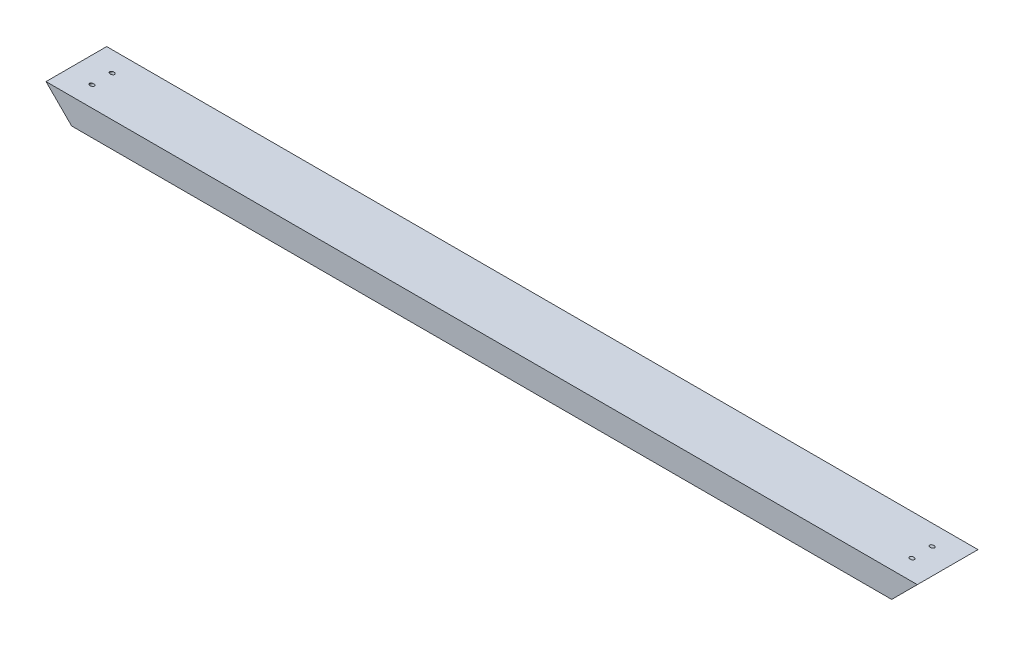
ISO-10303-21;
HEADER;
FILE_DESCRIPTION(('STEP AP214'),'2;1');
FILE_NAME('part.step','',(''),(''),'','','');
FILE_SCHEMA(('AUTOMOTIVE_DESIGN { 1 0 10303 214 1 1 1 1 }'));
ENDSEC;
DATA;
#1=APPLICATION_CONTEXT('core data for automotive mechanical design processes');
#2=APPLICATION_PROTOCOL_DEFINITION('international standard','automotive_design',2000,#1);
#3=PRODUCT_CONTEXT('',#1,'mechanical');
#4=PRODUCT('Part','Part','',(#3));
#5=PRODUCT_RELATED_PRODUCT_CATEGORY('part','',(#4));
#6=PRODUCT_DEFINITION_FORMATION('','',#4);
#7=PRODUCT_DEFINITION_CONTEXT('part definition',#1,'design');
#8=PRODUCT_DEFINITION('design','',#6,#7);
#9=PRODUCT_DEFINITION_SHAPE('','',#8);
#10=(LENGTH_UNIT() NAMED_UNIT(*) SI_UNIT(.MILLI.,.METRE.));
#11=(NAMED_UNIT(*) PLANE_ANGLE_UNIT() SI_UNIT($,.RADIAN.));
#12=(NAMED_UNIT(*) SI_UNIT($,.STERADIAN.) SOLID_ANGLE_UNIT());
#13=UNCERTAINTY_MEASURE_WITH_UNIT(LENGTH_MEASURE(1.E-05),#10,'distance_accuracy_value','');
#14=(GEOMETRIC_REPRESENTATION_CONTEXT(3) GLOBAL_UNCERTAINTY_ASSIGNED_CONTEXT((#13)) GLOBAL_UNIT_ASSIGNED_CONTEXT((#10,
#11,#12)) REPRESENTATION_CONTEXT('',''));
#15=CARTESIAN_POINT('',(0.,0.,0.));
#16=DIRECTION('',(0.,0.,1.));
#17=DIRECTION('',(1.,0.,0.));
#18=AXIS2_PLACEMENT_3D('',#15,#16,#17);
#19=CARTESIAN_POINT('',(-29.25630148811,26.4871636246753,88.9));
#20=DIRECTION('',(0.707106781186548,0.707106781186547,0.));
#21=DIRECTION('',(-0.707106781186547,0.707106781186548,0.));
#22=AXIS2_PLACEMENT_3D('',#19,#20,#21);
#23=PLANE('',#22);
#24=CARTESIAN_POINT('',(-10.4600139123982,7.69087604896351,29.6333333333333));
#25=DIRECTION('',(-0.707106781186549,-0.707106781186546,0.));
#26=DIRECTION('',(0.707106781186546,-0.707106781186549,0.));
#27=AXIS2_PLACEMENT_3D('',#24,#25,#26);
#28=CIRCLE('',#27,2.5796875);
#29=CARTESIAN_POINT('',(-8.63589938780602,5.86676152437133,29.6333333333333));
#30=VERTEX_POINT('',#29);
#31=EDGE_CURVE('E115',#30,#30,#28,.T.);
#32=ORIENTED_EDGE('',*,*,#31,.F.);
#33=EDGE_LOOP('',(#32));
#34=FACE_BOUND('',#33,.T.);
#35=CARTESIAN_POINT('',(-10.4600139123982,7.69087604896351,59.2666666666667));
#36=DIRECTION('',(-0.707106781186549,-0.707106781186546,0.));
#37=DIRECTION('',(0.707106781186546,-0.707106781186549,0.));
#38=AXIS2_PLACEMENT_3D('',#35,#36,#37);
#39=CIRCLE('',#38,2.5796875);
#40=CARTESIAN_POINT('',(-8.63589938780603,5.86676152437134,59.2666666666667));
#41=VERTEX_POINT('',#40);
#42=EDGE_CURVE('E123',#41,#41,#39,.T.);
#43=ORIENTED_EDGE('',*,*,#42,.F.);
#44=EDGE_LOOP('',(#43));
#45=FACE_BOUND('',#44,.T.);
#46=DIRECTION('',(0.707106781186547,-0.707106781186548,0.));
#47=VECTOR('',#46,1.);
#48=CARTESIAN_POINT('',(-29.25630148811,26.4871636246753,0.));
#49=LINE('',#48,#47);
#50=CARTESIAN_POINT('',(-29.25630148811,26.4871636246753,0.));
#51=VERTEX_POINT('',#50);
#52=CARTESIAN_POINT('',(8.33627366331358,-11.1054115267483,0.));
#53=VERTEX_POINT('',#52);
#54=EDGE_CURVE('E103',#51,#53,#49,.T.);
#55=ORIENTED_EDGE('',*,*,#54,.T.);
#56=DIRECTION('',(0.,0.,-1.));
#57=VECTOR('',#56,1.);
#58=CARTESIAN_POINT('',(8.33627366331358,-11.1054115267483,88.9));
#59=LINE('',#58,#57);
#60=CARTESIAN_POINT('',(8.33627366331358,-11.1054115267483,88.9));
#61=VERTEX_POINT('',#60);
#62=EDGE_CURVE('E11',#61,#53,#59,.T.);
#63=ORIENTED_EDGE('',*,*,#62,.F.);
#64=DIRECTION('',(0.707106781186547,-0.707106781186548,0.));
#65=VECTOR('',#64,1.);
#66=CARTESIAN_POINT('',(-29.25630148811,26.4871636246753,88.9));
#67=LINE('',#66,#65);
#68=CARTESIAN_POINT('',(-29.25630148811,26.4871636246753,88.9));
#69=VERTEX_POINT('',#68);
#70=EDGE_CURVE('E90',#69,#61,#67,.T.);
#71=ORIENTED_EDGE('',*,*,#70,.F.);
#72=DIRECTION('',(0.,0.,-1.));
#73=VECTOR('',#72,1.);
#74=CARTESIAN_POINT('',(-29.25630148811,26.4871636246753,88.9));
#75=LINE('',#74,#73);
#76=EDGE_CURVE('E99',#69,#51,#75,.T.);
#77=ORIENTED_EDGE('',*,*,#76,.T.);
#78=EDGE_LOOP('',(#55,#63,#71,#77));
#79=FACE_BOUND('',#78,.T.);
#80=ADVANCED_FACE('F37',(#34,#45,#79),#23,.F.);
#81=CARTESIAN_POINT('',(8.33627366331358,-11.1054115267483,88.9));
#82=DIRECTION('',(0.,1.,0.));
#83=DIRECTION('',(0.,0.,1.));
#84=AXIS2_PLACEMENT_3D('',#81,#82,#83);
#85=PLANE('',#84);
#86=DIRECTION('',(1.,0.,0.));
#87=VECTOR('',#86,1.);
#88=CARTESIAN_POINT('',(8.33627366331358,-11.1054115267483,0.));
#89=LINE('',#88,#87);
#90=CARTESIAN_POINT('',(1209.83189851189,-11.1054115267483,0.));
#91=VERTEX_POINT('',#90);
#92=EDGE_CURVE('E94',#53,#91,#89,.T.);
#93=ORIENTED_EDGE('',*,*,#92,.T.);
#94=DIRECTION('',(0.,0.,-1.));
#95=VECTOR('',#94,1.);
#96=CARTESIAN_POINT('',(1209.83189851189,-11.1054115267483,88.9));
#97=LINE('',#96,#95);
#98=CARTESIAN_POINT('',(1209.83189851189,-11.1054115267483,88.9));
#99=VERTEX_POINT('',#98);
#100=EDGE_CURVE('E46',#99,#91,#97,.T.);
#101=ORIENTED_EDGE('',*,*,#100,.F.);
#102=DIRECTION('',(1.,0.,0.));
#103=VECTOR('',#102,1.);
#104=CARTESIAN_POINT('',(8.33627366331358,-11.1054115267483,88.9));
#105=LINE('',#104,#103);
#106=EDGE_CURVE('E85',#61,#99,#105,.T.);
#107=ORIENTED_EDGE('',*,*,#106,.F.);
#108=ORIENTED_EDGE('',*,*,#62,.T.);
#109=EDGE_LOOP('',(#93,#101,#107,#108));
#110=FACE_BOUND('',#109,.T.);
#111=ADVANCED_FACE('F93',(#110),#85,.F.);
#112=CARTESIAN_POINT('',(1247.42447366331,26.4871636246753,88.9));
#113=DIRECTION('',(-0.707106781186543,0.707106781186553,0.));
#114=DIRECTION('',(-0.707106781186553,-0.707106781186543,0.));
#115=AXIS2_PLACEMENT_3D('',#112,#113,#114);
#116=PLANE('',#115);
#117=CARTESIAN_POINT('',(1228.6281860876,7.69087604896435,59.2666666666667));
#118=DIRECTION('',(0.707106781186544,-0.707106781186551,0.));
#119=DIRECTION('',(0.707106781186551,0.707106781186544,0.));
#120=AXIS2_PLACEMENT_3D('',#117,#118,#119);
#121=CIRCLE('',#120,2.57968750000005);
#122=CARTESIAN_POINT('',(1230.45230061219,9.51499057355655,59.2666666666667));
#123=VERTEX_POINT('',#122);
#124=EDGE_CURVE('E119',#123,#123,#121,.T.);
#125=ORIENTED_EDGE('',*,*,#124,.F.);
#126=EDGE_LOOP('',(#125));
#127=FACE_BOUND('',#126,.T.);
#128=CARTESIAN_POINT('',(1228.6281860876,7.69087604896435,29.6333333333333));
#129=DIRECTION('',(0.707106781186544,-0.707106781186551,0.));
#130=DIRECTION('',(0.707106781186551,0.707106781186544,0.));
#131=AXIS2_PLACEMENT_3D('',#128,#129,#130);
#132=CIRCLE('',#131,2.57968750000004);
#133=CARTESIAN_POINT('',(1230.45230061219,9.51499057355653,29.6333333333333));
#134=VERTEX_POINT('',#133);
#135=EDGE_CURVE('E125',#134,#134,#132,.T.);
#136=ORIENTED_EDGE('',*,*,#135,.F.);
#137=EDGE_LOOP('',(#136));
#138=FACE_BOUND('',#137,.T.);
#139=DIRECTION('',(0.707106781186552,0.707106781186543,0.));
#140=VECTOR('',#139,1.);
#141=CARTESIAN_POINT('',(1247.42447366331,26.4871636246753,0.));
#142=LINE('',#141,#140);
#143=CARTESIAN_POINT('',(1247.42447366331,26.4871636246753,0.));
#144=VERTEX_POINT('',#143);
#145=EDGE_CURVE('E72',#91,#144,#142,.T.);
#146=ORIENTED_EDGE('',*,*,#145,.T.);
#147=DIRECTION('',(0.,0.,-1.));
#148=VECTOR('',#147,1.);
#149=CARTESIAN_POINT('',(1247.42447366331,26.4871636246753,88.9));
#150=LINE('',#149,#148);
#151=CARTESIAN_POINT('',(1247.42447366331,26.4871636246753,88.9));
#152=VERTEX_POINT('',#151);
#153=EDGE_CURVE('E95',#152,#144,#150,.T.);
#154=ORIENTED_EDGE('',*,*,#153,.F.);
#155=DIRECTION('',(0.707106781186552,0.707106781186543,0.));
#156=VECTOR('',#155,1.);
#157=CARTESIAN_POINT('',(1247.42447366331,26.4871636246753,88.9));
#158=LINE('',#157,#156);
#159=EDGE_CURVE('E88',#99,#152,#158,.T.);
#160=ORIENTED_EDGE('',*,*,#159,.F.);
#161=ORIENTED_EDGE('',*,*,#100,.T.);
#162=EDGE_LOOP('',(#146,#154,#160,#161));
#163=FACE_BOUND('',#162,.T.);
#164=ADVANCED_FACE('F97',(#127,#138,#163),#116,.F.);
#165=CARTESIAN_POINT('',(-29.25630148811,26.4871636246753,88.9));
#166=DIRECTION('',(0.,-1.,0.));
#167=DIRECTION('',(0.,0.,-1.));
#168=AXIS2_PLACEMENT_3D('',#165,#166,#167);
#169=PLANE('',#168);
#170=CARTESIAN_POINT('',(1209.83189851189,26.4871636246753,59.2666666666667));
#171=DIRECTION('',(0.,-1.,0.));
#172=DIRECTION('',(1.,0.,0.));
#173=AXIS2_PLACEMENT_3D('',#170,#171,#172);
#174=ELLIPSE('',#173,3.6482290491844,2.57968750000005);
#175=CARTESIAN_POINT('',(1213.48012756107,26.4871636246753,59.2666666666667));
#176=VERTEX_POINT('',#175);
#177=EDGE_CURVE('E40',#176,#176,#174,.T.);
#178=ORIENTED_EDGE('',*,*,#177,.T.);
#179=EDGE_LOOP('',(#178));
#180=FACE_BOUND('',#179,.T.);
#181=CARTESIAN_POINT('',(1209.83189851189,26.4871636246753,29.6333333333333));
#182=DIRECTION('',(0.,-1.,0.));
#183=DIRECTION('',(1.,0.,0.));
#184=AXIS2_PLACEMENT_3D('',#181,#182,#183);
#185=ELLIPSE('',#184,3.64822904918438,2.57968750000004);
#186=CARTESIAN_POINT('',(1213.48012756107,26.4871636246753,29.6333333333333));
#187=VERTEX_POINT('',#186);
#188=EDGE_CURVE('E117',#187,#187,#185,.T.);
#189=ORIENTED_EDGE('',*,*,#188,.T.);
#190=EDGE_LOOP('',(#189));
#191=FACE_BOUND('',#190,.T.);
#192=CARTESIAN_POINT('',(8.3362736633138,26.4871636246753,29.6333333333333));
#193=DIRECTION('',(0.,-1.,0.));
#194=DIRECTION('',(-1.,0.,0.));
#195=AXIS2_PLACEMENT_3D('',#192,#193,#194);
#196=ELLIPSE('',#195,3.64822904918435,2.5796875);
#197=CARTESIAN_POINT('',(4.68804461412944,26.4871636246753,29.6333333333333));
#198=VERTEX_POINT('',#197);
#199=EDGE_CURVE('E106',#198,#198,#196,.T.);
#200=ORIENTED_EDGE('',*,*,#199,.T.);
#201=EDGE_LOOP('',(#200));
#202=FACE_BOUND('',#201,.T.);
#203=CARTESIAN_POINT('',(8.3362736633138,26.4871636246753,59.2666666666667));
#204=DIRECTION('',(0.,-1.,0.));
#205=DIRECTION('',(-1.,0.,0.));
#206=AXIS2_PLACEMENT_3D('',#203,#204,#205);
#207=ELLIPSE('',#206,3.64822904918434,2.5796875);
#208=CARTESIAN_POINT('',(4.68804461412945,26.4871636246753,59.2666666666667));
#209=VERTEX_POINT('',#208);
#210=EDGE_CURVE('E112',#209,#209,#207,.T.);
#211=ORIENTED_EDGE('',*,*,#210,.T.);
#212=EDGE_LOOP('',(#211));
#213=FACE_BOUND('',#212,.T.);
#214=DIRECTION('',(-1.,0.,0.));
#215=VECTOR('',#214,1.);
#216=CARTESIAN_POINT('',(-29.25630148811,26.4871636246753,0.));
#217=LINE('',#216,#215);
#218=EDGE_CURVE('E78',#144,#51,#217,.T.);
#219=ORIENTED_EDGE('',*,*,#218,.T.);
#220=ORIENTED_EDGE('',*,*,#76,.F.);
#221=DIRECTION('',(-1.,0.,0.));
#222=VECTOR('',#221,1.);
#223=CARTESIAN_POINT('',(-29.25630148811,26.4871636246753,88.9));
#224=LINE('',#223,#222);
#225=EDGE_CURVE('E55',#152,#69,#224,.T.);
#226=ORIENTED_EDGE('',*,*,#225,.F.);
#227=ORIENTED_EDGE('',*,*,#153,.T.);
#228=EDGE_LOOP('',(#219,#220,#226,#227));
#229=FACE_BOUND('',#228,.T.);
#230=ADVANCED_FACE('F154',(#180,#191,#202,#213,#229),#169,.F.);
#231=CARTESIAN_POINT('',(0.,0.,88.9));
#232=DIRECTION('',(0.,0.,-1.));
#233=DIRECTION('',(-1.,0.,0.));
#234=AXIS2_PLACEMENT_3D('',#231,#232,#233);
#235=PLANE('',#234);
#236=ORIENTED_EDGE('',*,*,#70,.T.);
#237=ORIENTED_EDGE('',*,*,#106,.T.);
#238=ORIENTED_EDGE('',*,*,#159,.T.);
#239=ORIENTED_EDGE('',*,*,#225,.T.);
#240=EDGE_LOOP('',(#236,#237,#238,#239));
#241=FACE_BOUND('',#240,.T.);
#242=ADVANCED_FACE('F86',(#241),#235,.F.);
#243=CARTESIAN_POINT('',(0.,0.,0.));
#244=DIRECTION('',(0.,0.,-1.));
#245=DIRECTION('',(-1.,0.,0.));
#246=AXIS2_PLACEMENT_3D('',#243,#244,#245);
#247=PLANE('',#246);
#248=ORIENTED_EDGE('',*,*,#54,.F.);
#249=ORIENTED_EDGE('',*,*,#218,.F.);
#250=ORIENTED_EDGE('',*,*,#145,.F.);
#251=ORIENTED_EDGE('',*,*,#92,.F.);
#252=EDGE_LOOP('',(#248,#249,#250,#251));
#253=FACE_BOUND('',#252,.T.);
#254=ADVANCED_FACE('F145',(#253),#247,.T.);
#255=CARTESIAN_POINT('',(627.880373663316,646.031263624675,59.2666666666667));
#256=DIRECTION('',(-0.707106781186549,-0.707106781186546,0.));
#257=DIRECTION('',(0.707106781186546,-0.707106781186549,0.));
#258=AXIS2_PLACEMENT_3D('',#255,#256,#257);
#259=CYLINDRICAL_SURFACE('',#258,2.5796875);
#260=ORIENTED_EDGE('',*,*,#42,.T.);
#261=EDGE_LOOP('',(#260));
#262=FACE_BOUND('',#261,.T.);
#263=ORIENTED_EDGE('',*,*,#210,.F.);
#264=EDGE_LOOP('',(#263));
#265=FACE_BOUND('',#264,.T.);
#266=ADVANCED_FACE('F137',(#262,#265),#259,.F.);
#267=CARTESIAN_POINT('',(627.880373663316,646.031263624675,29.6333333333333));
#268=DIRECTION('',(-0.707106781186549,-0.707106781186546,0.));
#269=DIRECTION('',(0.707106781186546,-0.707106781186549,0.));
#270=AXIS2_PLACEMENT_3D('',#267,#268,#269);
#271=CYLINDRICAL_SURFACE('',#270,2.5796875);
#272=ORIENTED_EDGE('',*,*,#31,.T.);
#273=EDGE_LOOP('',(#272));
#274=FACE_BOUND('',#273,.T.);
#275=ORIENTED_EDGE('',*,*,#199,.F.);
#276=EDGE_LOOP('',(#275));
#277=FACE_BOUND('',#276,.T.);
#278=ADVANCED_FACE('F152',(#274,#277),#271,.F.);
#279=CARTESIAN_POINT('',(590.287798511896,646.031263624675,29.6333333333333));
#280=DIRECTION('',(0.707106781186544,-0.707106781186551,0.));
#281=DIRECTION('',(0.707106781186551,0.707106781186544,0.));
#282=AXIS2_PLACEMENT_3D('',#279,#280,#281);
#283=CYLINDRICAL_SURFACE('',#282,2.57968750000004);
#284=ORIENTED_EDGE('',*,*,#135,.T.);
#285=EDGE_LOOP('',(#284));
#286=FACE_BOUND('',#285,.T.);
#287=ORIENTED_EDGE('',*,*,#188,.F.);
#288=EDGE_LOOP('',(#287));
#289=FACE_BOUND('',#288,.T.);
#290=ADVANCED_FACE('F202',(#286,#289),#283,.F.);
#291=CARTESIAN_POINT('',(590.287798511896,646.031263624675,59.2666666666667));
#292=DIRECTION('',(0.707106781186544,-0.707106781186551,0.));
#293=DIRECTION('',(0.707106781186551,0.707106781186544,0.));
#294=AXIS2_PLACEMENT_3D('',#291,#292,#293);
#295=CYLINDRICAL_SURFACE('',#294,2.57968750000005);
#296=ORIENTED_EDGE('',*,*,#124,.T.);
#297=EDGE_LOOP('',(#296));
#298=FACE_BOUND('',#297,.T.);
#299=ORIENTED_EDGE('',*,*,#177,.F.);
#300=EDGE_LOOP('',(#299));
#301=FACE_BOUND('',#300,.T.);
#302=ADVANCED_FACE('F212',(#298,#301),#295,.F.);
#303=CLOSED_SHELL('',(#80,#111,#164,#230,#242,#254,#266,#278,#290,#302));
#304=MANIFOLD_SOLID_BREP('B2',#303);
#305=ADVANCED_BREP_SHAPE_REPRESENTATION('',(#18,#304),#14);
#306=SHAPE_DEFINITION_REPRESENTATION(#9,#305);
ENDSEC;
END-ISO-10303-21;
